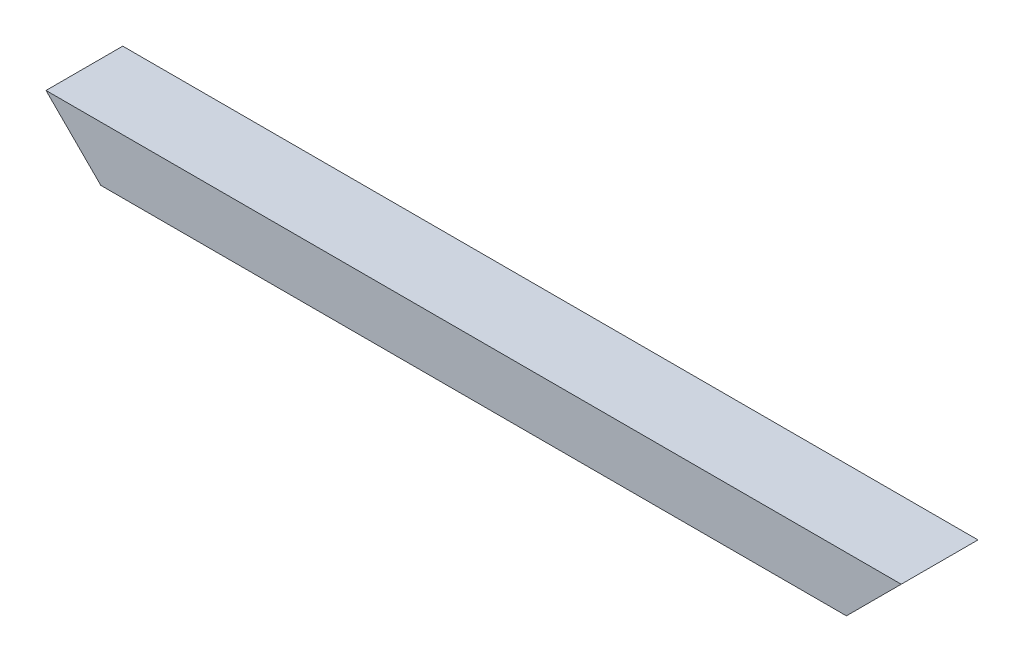
ISO-10303-21;
HEADER;
FILE_DESCRIPTION(('STEP AP214'),'2;1');
FILE_NAME('part.step','',(''),(''),'','','');
FILE_SCHEMA(('AUTOMOTIVE_DESIGN { 1 0 10303 214 1 1 1 1 }'));
ENDSEC;
DATA;
#1=APPLICATION_CONTEXT('core data for automotive mechanical design processes');
#2=APPLICATION_PROTOCOL_DEFINITION('international standard','automotive_design',2000,#1);
#3=PRODUCT_CONTEXT('',#1,'mechanical');
#4=PRODUCT('Part','Part','',(#3));
#5=PRODUCT_RELATED_PRODUCT_CATEGORY('part','',(#4));
#6=PRODUCT_DEFINITION_FORMATION('','',#4);
#7=PRODUCT_DEFINITION_CONTEXT('part definition',#1,'design');
#8=PRODUCT_DEFINITION('design','',#6,#7);
#9=PRODUCT_DEFINITION_SHAPE('','',#8);
#10=(LENGTH_UNIT() NAMED_UNIT(*) SI_UNIT(.MILLI.,.METRE.));
#11=(NAMED_UNIT(*) PLANE_ANGLE_UNIT() SI_UNIT($,.RADIAN.));
#12=(NAMED_UNIT(*) SI_UNIT($,.STERADIAN.) SOLID_ANGLE_UNIT());
#13=UNCERTAINTY_MEASURE_WITH_UNIT(LENGTH_MEASURE(1.E-05),#10,'distance_accuracy_value','');
#14=(GEOMETRIC_REPRESENTATION_CONTEXT(3) GLOBAL_UNCERTAINTY_ASSIGNED_CONTEXT((#13)) GLOBAL_UNIT_ASSIGNED_CONTEXT((#10,
#11,#12)) REPRESENTATION_CONTEXT('',''));
#15=CARTESIAN_POINT('',(0.,0.,0.));
#16=DIRECTION('',(0.,0.,1.));
#17=DIRECTION('',(1.,0.,0.));
#18=AXIS2_PLACEMENT_3D('',#15,#16,#17);
#19=CARTESIAN_POINT('',(-63.5000000000006,63.4999999999999,88.9));
#20=DIRECTION('',(0.707106781186543,0.707106781186552,0.));
#21=DIRECTION('',(-0.707106781186552,0.707106781186543,0.));
#22=AXIS2_PLACEMENT_3D('',#19,#20,#21);
#23=PLANE('',#22);
#24=DIRECTION('',(0.707106781186552,-0.707106781186544,0.));
#25=VECTOR('',#24,1.);
#26=CARTESIAN_POINT('',(-63.5000000000006,63.4999999999999,0.));
#27=LINE('',#26,#25);
#28=CARTESIAN_POINT('',(-63.5000000000006,63.4999999999999,0.));
#29=VERTEX_POINT('',#28);
#30=CARTESIAN_POINT('',(0.,0.,0.));
#31=VERTEX_POINT('',#30);
#32=EDGE_CURVE('E97',#29,#31,#27,.T.);
#33=ORIENTED_EDGE('',*,*,#32,.T.);
#34=DIRECTION('',(0.,0.,-1.));
#35=VECTOR('',#34,1.);
#36=CARTESIAN_POINT('',(0.,0.,88.9));
#37=LINE('',#36,#35);
#38=CARTESIAN_POINT('',(0.,0.,88.9));
#39=VERTEX_POINT('',#38);
#40=EDGE_CURVE('E11',#39,#31,#37,.T.);
#41=ORIENTED_EDGE('',*,*,#40,.F.);
#42=DIRECTION('',(0.707106781186552,-0.707106781186544,0.));
#43=VECTOR('',#42,1.);
#44=CARTESIAN_POINT('',(-63.5000000000006,63.4999999999999,88.9));
#45=LINE('',#44,#43);
#46=CARTESIAN_POINT('',(-63.5000000000006,63.4999999999999,88.9));
#47=VERTEX_POINT('',#46);
#48=EDGE_CURVE('E85',#47,#39,#45,.T.);
#49=ORIENTED_EDGE('',*,*,#48,.F.);
#50=DIRECTION('',(0.,0.,-1.));
#51=VECTOR('',#50,1.);
#52=CARTESIAN_POINT('',(-63.5000000000006,63.4999999999999,88.9));
#53=LINE('',#52,#51);
#54=EDGE_CURVE('E93',#47,#29,#53,.T.);
#55=ORIENTED_EDGE('',*,*,#54,.T.);
#56=EDGE_LOOP('',(#33,#41,#49,#55));
#57=FACE_BOUND('',#56,.T.);
#58=ADVANCED_FACE('F34',(#57),#23,.F.);
#59=CARTESIAN_POINT('',(0.,0.,88.9));
#60=DIRECTION('',(0.,1.,0.));
#61=DIRECTION('',(0.,0.,1.));
#62=AXIS2_PLACEMENT_3D('',#59,#60,#61);
#63=PLANE('',#62);
#64=DIRECTION('',(1.,0.,0.));
#65=VECTOR('',#64,1.);
#66=CARTESIAN_POINT('',(0.,0.,0.));
#67=LINE('',#66,#65);
#68=CARTESIAN_POINT('',(863.6,0.,0.));
#69=VERTEX_POINT('',#68);
#70=EDGE_CURVE('E89',#31,#69,#67,.T.);
#71=ORIENTED_EDGE('',*,*,#70,.T.);
#72=DIRECTION('',(0.,0.,-1.));
#73=VECTOR('',#72,1.);
#74=CARTESIAN_POINT('',(863.6,0.,88.9));
#75=LINE('',#74,#73);
#76=CARTESIAN_POINT('',(863.6,0.,88.9));
#77=VERTEX_POINT('',#76);
#78=EDGE_CURVE('E42',#77,#69,#75,.T.);
#79=ORIENTED_EDGE('',*,*,#78,.F.);
#80=DIRECTION('',(1.,0.,0.));
#81=VECTOR('',#80,1.);
#82=CARTESIAN_POINT('',(0.,0.,88.9));
#83=LINE('',#82,#81);
#84=EDGE_CURVE('E80',#39,#77,#83,.T.);
#85=ORIENTED_EDGE('',*,*,#84,.F.);
#86=ORIENTED_EDGE('',*,*,#40,.T.);
#87=EDGE_LOOP('',(#71,#79,#85,#86));
#88=FACE_BOUND('',#87,.T.);
#89=ADVANCED_FACE('F88',(#88),#63,.F.);
#90=CARTESIAN_POINT('',(863.6,0.,88.9));
#91=DIRECTION('',(-0.707106781186544,0.707106781186551,0.));
#92=DIRECTION('',(-0.707106781186551,-0.707106781186544,0.));
#93=AXIS2_PLACEMENT_3D('',#90,#91,#92);
#94=PLANE('',#93);
#95=DIRECTION('',(0.707106781186551,0.707106781186544,0.));
#96=VECTOR('',#95,1.);
#97=CARTESIAN_POINT('',(863.6,0.,0.));
#98=LINE('',#97,#96);
#99=CARTESIAN_POINT('',(927.100000000001,63.5,0.));
#100=VERTEX_POINT('',#99);
#101=EDGE_CURVE('E67',#69,#100,#98,.T.);
#102=ORIENTED_EDGE('',*,*,#101,.T.);
#103=DIRECTION('',(0.,0.,-1.));
#104=VECTOR('',#103,1.);
#105=CARTESIAN_POINT('',(927.100000000001,63.5,88.9));
#106=LINE('',#105,#104);
#107=CARTESIAN_POINT('',(927.100000000001,63.5,88.9));
#108=VERTEX_POINT('',#107);
#109=EDGE_CURVE('E90',#108,#100,#106,.T.);
#110=ORIENTED_EDGE('',*,*,#109,.F.);
#111=DIRECTION('',(0.707106781186551,0.707106781186544,0.));
#112=VECTOR('',#111,1.);
#113=CARTESIAN_POINT('',(863.6,0.,88.9));
#114=LINE('',#113,#112);
#115=EDGE_CURVE('E83',#77,#108,#114,.T.);
#116=ORIENTED_EDGE('',*,*,#115,.F.);
#117=ORIENTED_EDGE('',*,*,#78,.T.);
#118=EDGE_LOOP('',(#102,#110,#116,#117));
#119=FACE_BOUND('',#118,.T.);
#120=ADVANCED_FACE('F91',(#119),#94,.F.);
#121=CARTESIAN_POINT('',(927.100000000001,63.5,88.9));
#122=DIRECTION('',(0.,-1.,0.));
#123=DIRECTION('',(1.,0.,0.));
#124=AXIS2_PLACEMENT_3D('',#121,#122,#123);
#125=PLANE('',#124);
#126=DIRECTION('',(-1.,0.,0.));
#127=VECTOR('',#126,1.);
#128=CARTESIAN_POINT('',(927.100000000001,63.5,0.));
#129=LINE('',#128,#127);
#130=EDGE_CURVE('E73',#100,#29,#129,.T.);
#131=ORIENTED_EDGE('',*,*,#130,.T.);
#132=ORIENTED_EDGE('',*,*,#54,.F.);
#133=DIRECTION('',(-1.,0.,0.));
#134=VECTOR('',#133,1.);
#135=CARTESIAN_POINT('',(927.100000000001,63.5,88.9));
#136=LINE('',#135,#134);
#137=EDGE_CURVE('E50',#108,#47,#136,.T.);
#138=ORIENTED_EDGE('',*,*,#137,.F.);
#139=ORIENTED_EDGE('',*,*,#109,.T.);
#140=EDGE_LOOP('',(#131,#132,#138,#139));
#141=FACE_BOUND('',#140,.T.);
#142=ADVANCED_FACE('F104',(#141),#125,.F.);
#143=CARTESIAN_POINT('',(0.,0.,88.9));
#144=DIRECTION('',(0.,0.,1.));
#145=DIRECTION('',(1.,0.,0.));
#146=AXIS2_PLACEMENT_3D('',#143,#144,#145);
#147=PLANE('',#146);
#148=ORIENTED_EDGE('',*,*,#48,.T.);
#149=ORIENTED_EDGE('',*,*,#84,.T.);
#150=ORIENTED_EDGE('',*,*,#115,.T.);
#151=ORIENTED_EDGE('',*,*,#137,.T.);
#152=EDGE_LOOP('',(#148,#149,#150,#151));
#153=FACE_BOUND('',#152,.T.);
#154=ADVANCED_FACE('F81',(#153),#147,.T.);
#155=CARTESIAN_POINT('',(0.,0.,0.));
#156=DIRECTION('',(0.,0.,1.));
#157=DIRECTION('',(1.,0.,0.));
#158=AXIS2_PLACEMENT_3D('',#155,#156,#157);
#159=PLANE('',#158);
#160=ORIENTED_EDGE('',*,*,#32,.F.);
#161=ORIENTED_EDGE('',*,*,#130,.F.);
#162=ORIENTED_EDGE('',*,*,#101,.F.);
#163=ORIENTED_EDGE('',*,*,#70,.F.);
#164=EDGE_LOOP('',(#160,#161,#162,#163));
#165=FACE_BOUND('',#164,.T.);
#166=ADVANCED_FACE('F107',(#165),#159,.F.);
#167=CLOSED_SHELL('',(#58,#89,#120,#142,#154,#166));
#168=MANIFOLD_SOLID_BREP('B2',#167);
#169=ADVANCED_BREP_SHAPE_REPRESENTATION('',(#18,#168),#14);
#170=SHAPE_DEFINITION_REPRESENTATION(#9,#169);
ENDSEC;
END-ISO-10303-21;
